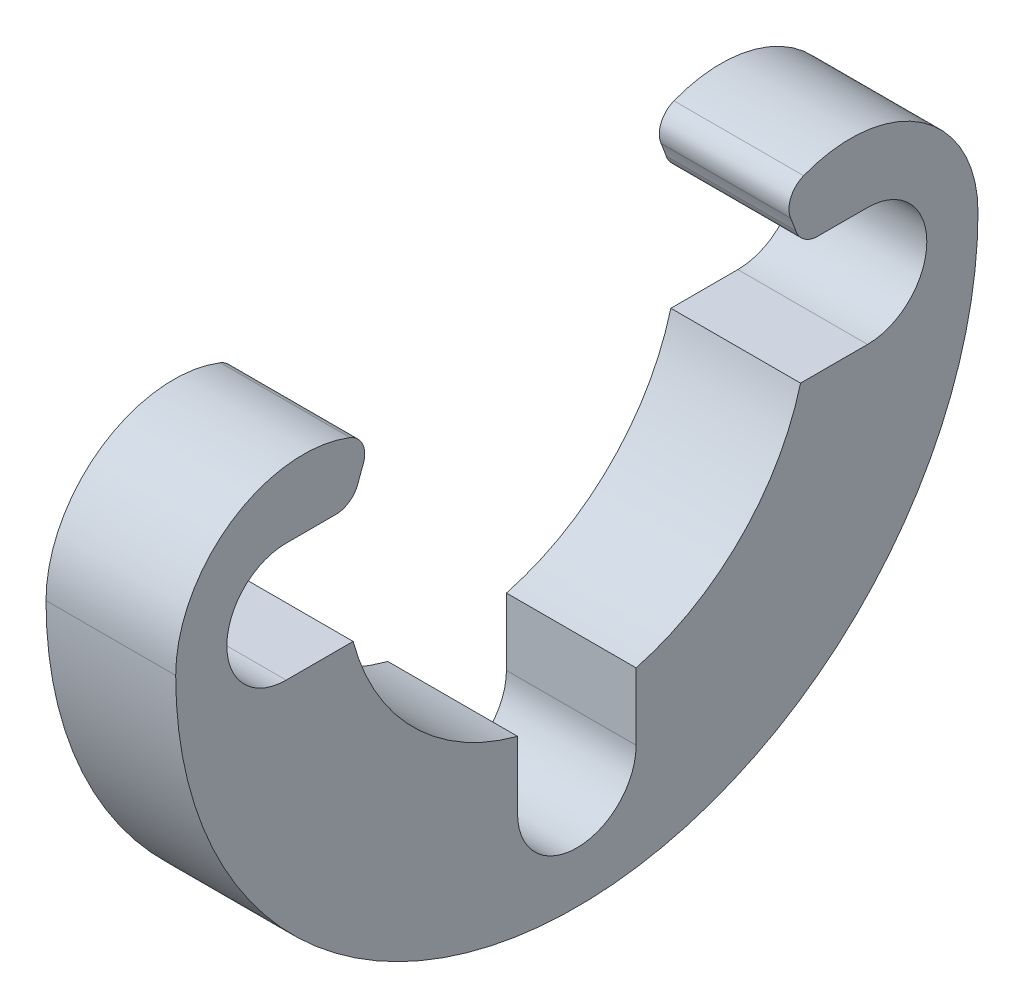
ISO-10303-21;
HEADER;
FILE_DESCRIPTION(('STEP AP214'),'2;1');
FILE_NAME('part.step','',(''),(''),'','','');
FILE_SCHEMA(('AUTOMOTIVE_DESIGN { 1 0 10303 214 1 1 1 1 }'));
ENDSEC;
DATA;
#1=APPLICATION_CONTEXT('core data for automotive mechanical design processes');
#2=APPLICATION_PROTOCOL_DEFINITION('international standard','automotive_design',2000,#1);
#3=PRODUCT_CONTEXT('',#1,'mechanical');
#4=PRODUCT('Part','Part','',(#3));
#5=PRODUCT_RELATED_PRODUCT_CATEGORY('part','',(#4));
#6=PRODUCT_DEFINITION_FORMATION('','',#4);
#7=PRODUCT_DEFINITION_CONTEXT('part definition',#1,'design');
#8=PRODUCT_DEFINITION('design','',#6,#7);
#9=PRODUCT_DEFINITION_SHAPE('','',#8);
#10=(LENGTH_UNIT() NAMED_UNIT(*) SI_UNIT(.MILLI.,.METRE.));
#11=(NAMED_UNIT(*) PLANE_ANGLE_UNIT() SI_UNIT($,.RADIAN.));
#12=(NAMED_UNIT(*) SI_UNIT($,.STERADIAN.) SOLID_ANGLE_UNIT());
#13=UNCERTAINTY_MEASURE_WITH_UNIT(LENGTH_MEASURE(1.E-05),#10,'distance_accuracy_value','');
#14=(GEOMETRIC_REPRESENTATION_CONTEXT(3) GLOBAL_UNCERTAINTY_ASSIGNED_CONTEXT((#13)) GLOBAL_UNIT_ASSIGNED_CONTEXT((#10,
#11,#12)) REPRESENTATION_CONTEXT('',''));
#15=CARTESIAN_POINT('',(0.,0.,0.));
#16=DIRECTION('',(0.,0.,1.));
#17=DIRECTION('',(1.,0.,0.));
#18=AXIS2_PLACEMENT_3D('',#15,#16,#17);
#19=CARTESIAN_POINT('',(-9.73629113398741,0.,7.97105));
#20=DIRECTION('',(1.,0.,0.));
#21=DIRECTION('',(0.,1.,0.));
#22=AXIS2_PLACEMENT_3D('',#19,#20,#21);
#23=CYLINDRICAL_SURFACE('',#22,1.6256);
#24=DIRECTION('',(-1.,0.,0.));
#25=VECTOR('',#24,1.);
#26=CARTESIAN_POINT('',(-1.5824,1.62560000000008,7.97105));
#27=LINE('',#26,#25);
#28=CARTESIAN_POINT('',(-1.5824,1.62560000000008,7.97105));
#29=VERTEX_POINT('',#28);
#30=CARTESIAN_POINT('',(-5.1384,1.62560000000008,7.97105));
#31=VERTEX_POINT('',#30);
#32=EDGE_CURVE('E239',#29,#31,#27,.T.);
#33=ORIENTED_EDGE('',*,*,#32,.F.);
#34=CARTESIAN_POINT('',(-1.5824,0.,7.97105));
#35=DIRECTION('',(1.,0.,0.));
#36=DIRECTION('',(0.,0.,1.));
#37=AXIS2_PLACEMENT_3D('',#34,#35,#36);
#38=CIRCLE('',#37,1.6256);
#39=CARTESIAN_POINT('',(-1.5824,-1.62559999999992,7.97105));
#40=VERTEX_POINT('',#39);
#41=EDGE_CURVE('E264',#29,#40,#38,.T.);
#42=ORIENTED_EDGE('',*,*,#41,.T.);
#43=DIRECTION('',(-1.,0.,0.));
#44=VECTOR('',#43,1.);
#45=CARTESIAN_POINT('',(-1.5824,-1.62559999999992,7.97105));
#46=LINE('',#45,#44);
#47=CARTESIAN_POINT('',(-5.1384,-1.62559999999992,7.97105));
#48=VERTEX_POINT('',#47);
#49=EDGE_CURVE('E241',#40,#48,#46,.T.);
#50=ORIENTED_EDGE('',*,*,#49,.T.);
#51=CARTESIAN_POINT('',(-5.1384,0.,7.97105));
#52=DIRECTION('',(-1.,0.,0.));
#53=DIRECTION('',(0.,-1.,0.));
#54=AXIS2_PLACEMENT_3D('',#51,#52,#53);
#55=CIRCLE('',#54,1.6256);
#56=EDGE_CURVE('E278',#31,#48,#55,.F.);
#57=ORIENTED_EDGE('',*,*,#56,.F.);
#58=EDGE_LOOP('',(#33,#42,#50,#57));
#59=FACE_BOUND('',#58,.T.);
#60=ADVANCED_FACE('F32',(#59),#23,.F.);
#61=CARTESIAN_POINT('',(-9.73629113398741,-7.97105,0.));
#62=DIRECTION('',(1.,0.,0.));
#63=DIRECTION('',(0.,1.,0.));
#64=AXIS2_PLACEMENT_3D('',#61,#62,#63);
#65=CYLINDRICAL_SURFACE('',#64,1.6256);
#66=DIRECTION('',(-1.,0.,0.));
#67=VECTOR('',#66,1.);
#68=CARTESIAN_POINT('',(-1.5824,-7.97105,1.6256));
#69=LINE('',#68,#67);
#70=CARTESIAN_POINT('',(-1.5824,-7.97105,1.6256));
#71=VERTEX_POINT('',#70);
#72=CARTESIAN_POINT('',(-5.1384,-7.97105,1.6256));
#73=VERTEX_POINT('',#72);
#74=EDGE_CURVE('E248',#71,#73,#69,.T.);
#75=ORIENTED_EDGE('',*,*,#74,.F.);
#76=CARTESIAN_POINT('',(-1.5824,-7.97105,0.));
#77=DIRECTION('',(1.,0.,0.));
#78=DIRECTION('',(0.,-1.,0.));
#79=AXIS2_PLACEMENT_3D('',#76,#77,#78);
#80=CIRCLE('',#79,1.6256);
#81=CARTESIAN_POINT('',(-1.5824,-7.97105,-1.6256));
#82=VERTEX_POINT('',#81);
#83=EDGE_CURVE('E275',#71,#82,#80,.T.);
#84=ORIENTED_EDGE('',*,*,#83,.T.);
#85=DIRECTION('',(-1.,0.,0.));
#86=VECTOR('',#85,1.);
#87=CARTESIAN_POINT('',(-1.5824,-7.97105,-1.6256));
#88=LINE('',#87,#86);
#89=CARTESIAN_POINT('',(-5.1384,-7.97105,-1.6256));
#90=VERTEX_POINT('',#89);
#91=EDGE_CURVE('E250',#82,#90,#88,.T.);
#92=ORIENTED_EDGE('',*,*,#91,.T.);
#93=CARTESIAN_POINT('',(-5.1384,-7.97105,0.));
#94=DIRECTION('',(-1.,0.,0.));
#95=DIRECTION('',(0.,-1.,0.));
#96=AXIS2_PLACEMENT_3D('',#93,#94,#95);
#97=CIRCLE('',#96,1.6256);
#98=EDGE_CURVE('E271',#73,#90,#97,.F.);
#99=ORIENTED_EDGE('',*,*,#98,.F.);
#100=EDGE_LOOP('',(#75,#84,#92,#99));
#101=FACE_BOUND('',#100,.T.);
#102=ADVANCED_FACE('F373',(#101),#65,.F.);
#103=CARTESIAN_POINT('',(0.,0.,0.));
#104=DIRECTION('',(1.,0.,0.));
#105=DIRECTION('',(0.,1.,0.));
#106=AXIS2_PLACEMENT_3D('',#103,#104,#105);
#107=CYLINDRICAL_SURFACE('',#106,11.);
#108=CARTESIAN_POINT('',(-1.5824,0.,0.));
#109=DIRECTION('',(1.,0.,0.));
#110=DIRECTION('',(0.,1.,0.));
#111=AXIS2_PLACEMENT_3D('',#108,#109,#110);
#112=CIRCLE('',#111,11.);
#113=CARTESIAN_POINT('',(-1.5824,0.,11.));
#114=VERTEX_POINT('',#113);
#115=CARTESIAN_POINT('',(-1.5824,0.,-11.));
#116=VERTEX_POINT('',#115);
#117=EDGE_CURVE('E274',#114,#116,#112,.T.);
#118=ORIENTED_EDGE('',*,*,#117,.F.);
#119=DIRECTION('',(-1.,0.,0.));
#120=VECTOR('',#119,1.);
#121=CARTESIAN_POINT('',(23.0143477524977,0.,11.));
#122=LINE('',#121,#120);
#123=CARTESIAN_POINT('',(-5.1384,0.,11.));
#124=VERTEX_POINT('',#123);
#125=EDGE_CURVE('E261',#114,#124,#122,.T.);
#126=ORIENTED_EDGE('',*,*,#125,.T.);
#127=CARTESIAN_POINT('',(-5.1384,0.,0.));
#128=DIRECTION('',(1.,0.,0.));
#129=DIRECTION('',(0.,1.,0.));
#130=AXIS2_PLACEMENT_3D('',#127,#128,#129);
#131=CIRCLE('',#130,11.);
#132=CARTESIAN_POINT('',(-5.1384,0.,-11.));
#133=VERTEX_POINT('',#132);
#134=EDGE_CURVE('E287',#124,#133,#131,.T.);
#135=ORIENTED_EDGE('',*,*,#134,.T.);
#136=DIRECTION('',(-1.,0.,0.));
#137=VECTOR('',#136,1.);
#138=CARTESIAN_POINT('',(23.0143477524977,0.,-11.));
#139=LINE('',#138,#137);
#140=EDGE_CURVE('E265',#116,#133,#139,.T.);
#141=ORIENTED_EDGE('',*,*,#140,.F.);
#142=EDGE_LOOP('',(#118,#126,#135,#141));
#143=FACE_BOUND('',#142,.T.);
#144=ADVANCED_FACE('F341',(#143),#107,.T.);
#145=CARTESIAN_POINT('',(-1.5824,11.,0.));
#146=DIRECTION('',(1.,0.,0.));
#147=DIRECTION('',(0.,1.,0.));
#148=AXIS2_PLACEMENT_3D('',#145,#146,#147);
#149=PLANE('',#148);
#150=CARTESIAN_POINT('',(-1.5824,0.,-7.5));
#151=DIRECTION('',(1.,0.,0.));
#152=DIRECTION('',(0.,1.,0.));
#153=AXIS2_PLACEMENT_3D('',#150,#151,#152);
#154=CIRCLE('',#153,3.5);
#155=CARTESIAN_POINT('',(-1.5824,3.25706571671838,-6.21878069130308));
#156=VERTEX_POINT('',#155);
#157=EDGE_CURVE('E262',#116,#156,#154,.T.);
#158=ORIENTED_EDGE('',*,*,#157,.T.);
#159=CARTESIAN_POINT('',(-1.5824,2.66614093668519,-6.45123048016667));
#160=DIRECTION('',(1.,0.,0.));
#161=DIRECTION('',(0.,1.,0.));
#162=AXIS2_PLACEMENT_3D('',#159,#160,#161);
#163=CIRCLE('',#162,0.635);
#164=CARTESIAN_POINT('',(-1.5824,2.42360650197179,-5.86437270525161));
#165=VERTEX_POINT('',#164);
#166=EDGE_CURVE('E299',#156,#165,#163,.T.);
#167=ORIENTED_EDGE('',*,*,#166,.T.);
#168=CARTESIAN_POINT('',(-1.5824,0.,0.));
#169=DIRECTION('',(-1.,0.,0.));
#170=DIRECTION('',(0.,-1.,0.));
#171=AXIS2_PLACEMENT_3D('',#168,#169,#170);
#172=CIRCLE('',#171,6.34545);
#173=CARTESIAN_POINT('',(-1.5824,2.05495695406454,-6.00348962016608));
#174=VERTEX_POINT('',#173);
#175=EDGE_CURVE('E212',#165,#174,#172,.T.);
#176=ORIENTED_EDGE('',*,*,#175,.T.);
#177=CARTESIAN_POINT('',(-1.5824,2.26059999999997,-6.60426906194017));
#178=DIRECTION('',(1.,0.,0.));
#179=DIRECTION('',(0.,1.,0.));
#180=AXIS2_PLACEMENT_3D('',#177,#178,#179);
#181=CIRCLE('',#180,0.635);
#182=CARTESIAN_POINT('',(-1.5824,1.62559999999997,-6.60426906194017));
#183=VERTEX_POINT('',#182);
#184=EDGE_CURVE('E297',#174,#183,#181,.T.);
#185=ORIENTED_EDGE('',*,*,#184,.T.);
#186=DIRECTION('',(0.,0.,-1.));
#187=VECTOR('',#186,1.);
#188=CARTESIAN_POINT('',(-1.5824,1.62559999999997,-7.97105));
#189=LINE('',#188,#187);
#190=CARTESIAN_POINT('',(-1.5824,1.62559999999997,-7.97105));
#191=VERTEX_POINT('',#190);
#192=EDGE_CURVE('E216',#183,#191,#189,.T.);
#193=ORIENTED_EDGE('',*,*,#192,.T.);
#194=CARTESIAN_POINT('',(-1.5824,0.,-7.97105));
#195=DIRECTION('',(1.,0.,0.));
#196=DIRECTION('',(0.,0.,-1.));
#197=AXIS2_PLACEMENT_3D('',#194,#195,#196);
#198=CIRCLE('',#197,1.6256);
#199=CARTESIAN_POINT('',(-1.5824,-1.62560000000003,-7.97105));
#200=VERTEX_POINT('',#199);
#201=EDGE_CURVE('E193',#200,#191,#198,.T.);
#202=ORIENTED_EDGE('',*,*,#201,.F.);
#203=DIRECTION('',(0.,0.,1.));
#204=VECTOR('',#203,1.);
#205=CARTESIAN_POINT('',(-1.5824,-1.62560000000003,-7.97105));
#206=LINE('',#205,#204);
#207=CARTESIAN_POINT('',(-1.5824,-1.62560000000002,-6.13369059722611));
#208=VERTEX_POINT('',#207);
#209=EDGE_CURVE('E171',#200,#208,#206,.T.);
#210=ORIENTED_EDGE('',*,*,#209,.T.);
#211=CARTESIAN_POINT('',(-1.5824,0.,0.));
#212=DIRECTION('',(-1.,0.,0.));
#213=DIRECTION('',(0.,-1.,0.));
#214=AXIS2_PLACEMENT_3D('',#211,#212,#213);
#215=CIRCLE('',#214,6.34545);
#216=CARTESIAN_POINT('',(-1.5824,-6.13369059722611,-1.6256));
#217=VERTEX_POINT('',#216);
#218=EDGE_CURVE('E182',#208,#217,#215,.T.);
#219=ORIENTED_EDGE('',*,*,#218,.T.);
#220=DIRECTION('',(0.,-1.,0.));
#221=VECTOR('',#220,1.);
#222=CARTESIAN_POINT('',(-1.5824,-7.97105,-1.6256));
#223=LINE('',#222,#221);
#224=EDGE_CURVE('E187',#217,#82,#223,.T.);
#225=ORIENTED_EDGE('',*,*,#224,.T.);
#226=ORIENTED_EDGE('',*,*,#83,.F.);
#227=DIRECTION('',(0.,1.,0.));
#228=VECTOR('',#227,1.);
#229=CARTESIAN_POINT('',(-1.5824,-7.97105,1.6256));
#230=LINE('',#229,#228);
#231=CARTESIAN_POINT('',(-1.5824,-6.13369059722611,1.6256));
#232=VERTEX_POINT('',#231);
#233=EDGE_CURVE('E200',#71,#232,#230,.T.);
#234=ORIENTED_EDGE('',*,*,#233,.T.);
#235=CARTESIAN_POINT('',(-1.5824,0.,0.));
#236=DIRECTION('',(-1.,0.,0.));
#237=DIRECTION('',(0.,-1.,0.));
#238=AXIS2_PLACEMENT_3D('',#235,#236,#237);
#239=CIRCLE('',#238,6.34545);
#240=CARTESIAN_POINT('',(-1.5824,-1.62560000000003,6.1336905972261));
#241=VERTEX_POINT('',#240);
#242=EDGE_CURVE('E203',#232,#241,#239,.T.);
#243=ORIENTED_EDGE('',*,*,#242,.T.);
#244=DIRECTION('',(0.,0.,1.));
#245=VECTOR('',#244,1.);
#246=CARTESIAN_POINT('',(-1.5824,-1.62559999999992,7.97105));
#247=LINE('',#246,#245);
#248=EDGE_CURVE('E206',#241,#40,#247,.T.);
#249=ORIENTED_EDGE('',*,*,#248,.T.);
#250=ORIENTED_EDGE('',*,*,#41,.F.);
#251=DIRECTION('',(0.,0.,-1.));
#252=VECTOR('',#251,1.);
#253=CARTESIAN_POINT('',(-1.5824,1.62560000000008,7.97105));
#254=LINE('',#253,#252);
#255=CARTESIAN_POINT('',(-1.5824,1.6256,6.6042690619402));
#256=VERTEX_POINT('',#255);
#257=EDGE_CURVE('E209',#29,#256,#254,.T.);
#258=ORIENTED_EDGE('',*,*,#257,.T.);
#259=CARTESIAN_POINT('',(-1.5824,2.2606,6.60426906194016));
#260=DIRECTION('',(1.,0.,0.));
#261=DIRECTION('',(0.,1.,0.));
#262=AXIS2_PLACEMENT_3D('',#259,#260,#261);
#263=CIRCLE('',#262,0.635);
#264=CARTESIAN_POINT('',(-1.5824,2.05495695406457,6.00348962016607));
#265=VERTEX_POINT('',#264);
#266=EDGE_CURVE('E293',#256,#265,#263,.T.);
#267=ORIENTED_EDGE('',*,*,#266,.T.);
#268=CARTESIAN_POINT('',(-1.5824,2.42360650197179,5.86437270525161));
#269=VERTEX_POINT('',#268);
#270=EDGE_CURVE('E215',#265,#269,#172,.T.);
#271=ORIENTED_EDGE('',*,*,#270,.T.);
#272=CARTESIAN_POINT('',(-1.5824,2.66614093668519,6.45123048016667));
#273=DIRECTION('',(1.,0.,0.));
#274=DIRECTION('',(0.,1.,0.));
#275=AXIS2_PLACEMENT_3D('',#272,#273,#274);
#276=CIRCLE('',#275,0.635);
#277=CARTESIAN_POINT('',(-1.5824,3.25706571671838,6.21878069130308));
#278=VERTEX_POINT('',#277);
#279=EDGE_CURVE('E295',#269,#278,#276,.T.);
#280=ORIENTED_EDGE('',*,*,#279,.T.);
#281=CARTESIAN_POINT('',(-1.5824,0.,7.5));
#282=DIRECTION('',(1.,0.,0.));
#283=DIRECTION('',(0.,1.,0.));
#284=AXIS2_PLACEMENT_3D('',#281,#282,#283);
#285=CIRCLE('',#284,3.5);
#286=EDGE_CURVE('E258',#278,#114,#285,.T.);
#287=ORIENTED_EDGE('',*,*,#286,.T.);
#288=ORIENTED_EDGE('',*,*,#117,.T.);
#289=EDGE_LOOP('',(#158,#167,#176,#185,#193,#202,#210,#219,#225,#226,#234,#243,#249,#250,#258,
#267,#271,#280,#287,#288));
#290=FACE_BOUND('',#289,.T.);
#291=ADVANCED_FACE('F191',(#290),#149,.T.);
#292=CARTESIAN_POINT('',(-5.1384,4.99999,0.));
#293=DIRECTION('',(-1.,0.,0.));
#294=DIRECTION('',(0.,-1.,0.));
#295=AXIS2_PLACEMENT_3D('',#292,#293,#294);
#296=PLANE('',#295);
#297=CARTESIAN_POINT('',(-5.1384,0.,0.));
#298=DIRECTION('',(-1.,0.,0.));
#299=DIRECTION('',(0.,-1.,0.));
#300=AXIS2_PLACEMENT_3D('',#297,#298,#299);
#301=CIRCLE('',#300,6.34545);
#302=CARTESIAN_POINT('',(-5.1384,2.42360650197179,-5.86437270525161));
#303=VERTEX_POINT('',#302);
#304=CARTESIAN_POINT('',(-5.1384,2.05495695406454,-6.00348962016608));
#305=VERTEX_POINT('',#304);
#306=EDGE_CURVE('E233',#303,#305,#301,.T.);
#307=ORIENTED_EDGE('',*,*,#306,.F.);
#308=CARTESIAN_POINT('',(-5.1384,2.66614093668519,-6.45123048016667));
#309=DIRECTION('',(-1.,0.,0.));
#310=DIRECTION('',(0.,-1.,0.));
#311=AXIS2_PLACEMENT_3D('',#308,#309,#310);
#312=CIRCLE('',#311,0.635);
#313=CARTESIAN_POINT('',(-5.1384,3.25706571671838,-6.21878069130308));
#314=VERTEX_POINT('',#313);
#315=EDGE_CURVE('E309',#303,#314,#312,.T.);
#316=ORIENTED_EDGE('',*,*,#315,.T.);
#317=CARTESIAN_POINT('',(-5.1384,0.,-7.5));
#318=DIRECTION('',(1.,0.,0.));
#319=DIRECTION('',(0.,-1.,0.));
#320=AXIS2_PLACEMENT_3D('',#317,#318,#319);
#321=CIRCLE('',#320,3.5);
#322=EDGE_CURVE('E255',#133,#314,#321,.T.);
#323=ORIENTED_EDGE('',*,*,#322,.F.);
#324=ORIENTED_EDGE('',*,*,#134,.F.);
#325=CARTESIAN_POINT('',(-5.1384,0.,7.5));
#326=DIRECTION('',(1.,0.,0.));
#327=DIRECTION('',(0.,1.,0.));
#328=AXIS2_PLACEMENT_3D('',#325,#326,#327);
#329=CIRCLE('',#328,3.5);
#330=CARTESIAN_POINT('',(-5.1384,3.25706571671838,6.21878069130308));
#331=VERTEX_POINT('',#330);
#332=EDGE_CURVE('E238',#331,#124,#329,.T.);
#333=ORIENTED_EDGE('',*,*,#332,.F.);
#334=CARTESIAN_POINT('',(-5.1384,2.66614093668519,6.45123048016667));
#335=DIRECTION('',(-1.,0.,0.));
#336=DIRECTION('',(0.,-1.,0.));
#337=AXIS2_PLACEMENT_3D('',#334,#335,#336);
#338=CIRCLE('',#337,0.635);
#339=CARTESIAN_POINT('',(-5.1384,2.42360650197179,5.86437270525161));
#340=VERTEX_POINT('',#339);
#341=EDGE_CURVE('E53',#331,#340,#338,.T.);
#342=ORIENTED_EDGE('',*,*,#341,.T.);
#343=CARTESIAN_POINT('',(-5.1384,2.05495695406457,6.00348962016607));
#344=VERTEX_POINT('',#343);
#345=EDGE_CURVE('E196',#344,#340,#301,.T.);
#346=ORIENTED_EDGE('',*,*,#345,.F.);
#347=CARTESIAN_POINT('',(-5.1384,2.2606,6.60426906194016));
#348=DIRECTION('',(-1.,0.,0.));
#349=DIRECTION('',(0.,-1.,0.));
#350=AXIS2_PLACEMENT_3D('',#347,#348,#349);
#351=CIRCLE('',#350,0.635);
#352=CARTESIAN_POINT('',(-5.1384,1.6256,6.6042690619402));
#353=VERTEX_POINT('',#352);
#354=EDGE_CURVE('E47',#344,#353,#351,.T.);
#355=ORIENTED_EDGE('',*,*,#354,.T.);
#356=DIRECTION('',(0.,0.,-1.));
#357=VECTOR('',#356,1.);
#358=CARTESIAN_POINT('',(-5.1384,1.62560000000008,7.97105));
#359=LINE('',#358,#357);
#360=EDGE_CURVE('E231',#31,#353,#359,.T.);
#361=ORIENTED_EDGE('',*,*,#360,.F.);
#362=ORIENTED_EDGE('',*,*,#56,.T.);
#363=DIRECTION('',(0.,0.,1.));
#364=VECTOR('',#363,1.);
#365=CARTESIAN_POINT('',(-5.1384,-1.62559999999992,7.97105));
#366=LINE('',#365,#364);
#367=CARTESIAN_POINT('',(-5.1384,-1.62560000000003,6.1336905972261));
#368=VERTEX_POINT('',#367);
#369=EDGE_CURVE('E229',#368,#48,#366,.T.);
#370=ORIENTED_EDGE('',*,*,#369,.F.);
#371=CARTESIAN_POINT('',(-5.1384,0.,0.));
#372=DIRECTION('',(-1.,0.,0.));
#373=DIRECTION('',(0.,-1.,0.));
#374=AXIS2_PLACEMENT_3D('',#371,#372,#373);
#375=CIRCLE('',#374,6.34545);
#376=CARTESIAN_POINT('',(-5.1384,-6.13369059722611,1.6256));
#377=VERTEX_POINT('',#376);
#378=EDGE_CURVE('E226',#377,#368,#375,.T.);
#379=ORIENTED_EDGE('',*,*,#378,.F.);
#380=DIRECTION('',(0.,1.,0.));
#381=VECTOR('',#380,1.);
#382=CARTESIAN_POINT('',(-5.1384,-7.97105,1.6256));
#383=LINE('',#382,#381);
#384=EDGE_CURVE('E223',#73,#377,#383,.T.);
#385=ORIENTED_EDGE('',*,*,#384,.F.);
#386=ORIENTED_EDGE('',*,*,#98,.T.);
#387=DIRECTION('',(0.,-1.,0.));
#388=VECTOR('',#387,1.);
#389=CARTESIAN_POINT('',(-5.1384,-7.97105,-1.6256));
#390=LINE('',#389,#388);
#391=CARTESIAN_POINT('',(-5.1384,-6.13369059722611,-1.6256));
#392=VERTEX_POINT('',#391);
#393=EDGE_CURVE('E221',#392,#90,#390,.T.);
#394=ORIENTED_EDGE('',*,*,#393,.F.);
#395=CARTESIAN_POINT('',(-5.1384,0.,0.));
#396=DIRECTION('',(-1.,0.,0.));
#397=DIRECTION('',(0.,-1.,0.));
#398=AXIS2_PLACEMENT_3D('',#395,#396,#397);
#399=CIRCLE('',#398,6.34545);
#400=CARTESIAN_POINT('',(-5.1384,-1.62560000000003,-6.13369059722611));
#401=VERTEX_POINT('',#400);
#402=EDGE_CURVE('E219',#401,#392,#399,.T.);
#403=ORIENTED_EDGE('',*,*,#402,.F.);
#404=DIRECTION('',(0.,0.,1.));
#405=VECTOR('',#404,1.);
#406=CARTESIAN_POINT('',(-5.1384,-1.62560000000003,-7.97105));
#407=LINE('',#406,#405);
#408=CARTESIAN_POINT('',(-5.1384,-1.62560000000003,-7.97105));
#409=VERTEX_POINT('',#408);
#410=EDGE_CURVE('E174',#409,#401,#407,.T.);
#411=ORIENTED_EDGE('',*,*,#410,.F.);
#412=CARTESIAN_POINT('',(-5.1384,0.,-7.97105));
#413=DIRECTION('',(-1.,0.,0.));
#414=DIRECTION('',(0.,-1.,0.));
#415=AXIS2_PLACEMENT_3D('',#412,#413,#414);
#416=CIRCLE('',#415,1.6256);
#417=CARTESIAN_POINT('',(-5.1384,1.62559999999997,-7.97105));
#418=VERTEX_POINT('',#417);
#419=EDGE_CURVE('E270',#409,#418,#416,.F.);
#420=ORIENTED_EDGE('',*,*,#419,.T.);
#421=DIRECTION('',(0.,0.,-1.));
#422=VECTOR('',#421,1.);
#423=CARTESIAN_POINT('',(-5.1384,1.62559999999997,-7.97105));
#424=LINE('',#423,#422);
#425=CARTESIAN_POINT('',(-5.1384,1.62559999999997,-6.60426906194017));
#426=VERTEX_POINT('',#425);
#427=EDGE_CURVE('E194',#426,#418,#424,.T.);
#428=ORIENTED_EDGE('',*,*,#427,.F.);
#429=CARTESIAN_POINT('',(-5.1384,2.26059999999997,-6.60426906194017));
#430=DIRECTION('',(-1.,0.,0.));
#431=DIRECTION('',(0.,-1.,0.));
#432=AXIS2_PLACEMENT_3D('',#429,#430,#431);
#433=CIRCLE('',#432,0.635);
#434=EDGE_CURVE('E307',#426,#305,#433,.T.);
#435=ORIENTED_EDGE('',*,*,#434,.T.);
#436=EDGE_LOOP('',(#307,#316,#323,#324,#333,#342,#346,#355,#361,#362,#370,#379,#385,#386,#394,
#403,#411,#420,#428,#435));
#437=FACE_BOUND('',#436,.T.);
#438=ADVANCED_FACE('F336',(#437),#296,.T.);
#439=CARTESIAN_POINT('',(-9.73629113398741,0.,-7.97105));
#440=DIRECTION('',(1.,0.,0.));
#441=DIRECTION('',(0.,1.,0.));
#442=AXIS2_PLACEMENT_3D('',#439,#440,#441);
#443=CYLINDRICAL_SURFACE('',#442,1.6256);
#444=ORIENTED_EDGE('',*,*,#201,.T.);
#445=DIRECTION('',(-1.,0.,0.));
#446=VECTOR('',#445,1.);
#447=CARTESIAN_POINT('',(-1.5824,1.62559999999997,-7.97105));
#448=LINE('',#447,#446);
#449=EDGE_CURVE('E235',#191,#418,#448,.T.);
#450=ORIENTED_EDGE('',*,*,#449,.T.);
#451=ORIENTED_EDGE('',*,*,#419,.F.);
#452=DIRECTION('',(-1.,0.,0.));
#453=VECTOR('',#452,1.);
#454=CARTESIAN_POINT('',(-1.5824,-1.62560000000003,-7.97105));
#455=LINE('',#454,#453);
#456=EDGE_CURVE('E179',#200,#409,#455,.T.);
#457=ORIENTED_EDGE('',*,*,#456,.F.);
#458=EDGE_LOOP('',(#444,#450,#451,#457));
#459=FACE_BOUND('',#458,.T.);
#460=ADVANCED_FACE('F365',(#459),#443,.F.);
#461=CARTESIAN_POINT('',(23.0143477524977,0.,7.5));
#462=DIRECTION('',(-1.,0.,0.));
#463=DIRECTION('',(0.,-1.,0.));
#464=AXIS2_PLACEMENT_3D('',#461,#462,#463);
#465=CYLINDRICAL_SURFACE('',#464,3.5);
#466=ORIENTED_EDGE('',*,*,#286,.F.);
#467=DIRECTION('',(-1.,0.,0.));
#468=VECTOR('',#467,1.);
#469=CARTESIAN_POINT('',(23.0143477524977,3.25706571671838,6.21878069130308));
#470=LINE('',#469,#468);
#471=EDGE_CURVE('E314',#278,#331,#470,.T.);
#472=ORIENTED_EDGE('',*,*,#471,.T.);
#473=ORIENTED_EDGE('',*,*,#332,.T.);
#474=ORIENTED_EDGE('',*,*,#125,.F.);
#475=EDGE_LOOP('',(#466,#472,#473,#474));
#476=FACE_BOUND('',#475,.T.);
#477=ADVANCED_FACE('F332',(#476),#465,.T.);
#478=CARTESIAN_POINT('',(23.0143477524977,0.,-7.5));
#479=DIRECTION('',(-1.,0.,0.));
#480=DIRECTION('',(0.,-1.,0.));
#481=AXIS2_PLACEMENT_3D('',#478,#479,#480);
#482=CYLINDRICAL_SURFACE('',#481,3.5);
#483=ORIENTED_EDGE('',*,*,#322,.T.);
#484=DIRECTION('',(-1.,0.,0.));
#485=VECTOR('',#484,1.);
#486=CARTESIAN_POINT('',(23.0143477524977,3.25706571671838,-6.21878069130308));
#487=LINE('',#486,#485);
#488=EDGE_CURVE('E290',#314,#156,#487,.F.);
#489=ORIENTED_EDGE('',*,*,#488,.T.);
#490=ORIENTED_EDGE('',*,*,#157,.F.);
#491=ORIENTED_EDGE('',*,*,#140,.T.);
#492=EDGE_LOOP('',(#483,#489,#490,#491));
#493=FACE_BOUND('',#492,.T.);
#494=ADVANCED_FACE('F344',(#493),#482,.T.);
#495=CARTESIAN_POINT('',(-1.5824,0.,0.));
#496=DIRECTION('',(-1.,0.,0.));
#497=DIRECTION('',(0.,-1.,0.));
#498=AXIS2_PLACEMENT_3D('',#495,#496,#497);
#499=CYLINDRICAL_SURFACE('',#498,6.34545);
#500=ORIENTED_EDGE('',*,*,#175,.F.);
#501=DIRECTION('',(-1.,0.,0.));
#502=VECTOR('',#501,1.);
#503=CARTESIAN_POINT('',(-1.5824,2.42360650197179,-5.86437270525161));
#504=LINE('',#503,#502);
#505=EDGE_CURVE('E303',#165,#303,#504,.T.);
#506=ORIENTED_EDGE('',*,*,#505,.T.);
#507=ORIENTED_EDGE('',*,*,#306,.T.);
#508=DIRECTION('',(-1.,0.,0.));
#509=VECTOR('',#508,1.);
#510=CARTESIAN_POINT('',(-1.5824,2.05495695406454,-6.00348962016608));
#511=LINE('',#510,#509);
#512=EDGE_CURVE('E301',#305,#174,#511,.F.);
#513=ORIENTED_EDGE('',*,*,#512,.T.);
#514=EDGE_LOOP('',(#500,#506,#507,#513));
#515=FACE_BOUND('',#514,.T.);
#516=ADVANCED_FACE('F352',(#515),#499,.F.);
#517=CARTESIAN_POINT('',(-1.5824,1.62559999999997,-7.97105));
#518=DIRECTION('',(0.,1.,0.));
#519=DIRECTION('',(-1.,0.,0.));
#520=AXIS2_PLACEMENT_3D('',#517,#518,#519);
#521=PLANE('',#520);
#522=ORIENTED_EDGE('',*,*,#192,.F.);
#523=DIRECTION('',(-1.,0.,0.));
#524=VECTOR('',#523,1.);
#525=CARTESIAN_POINT('',(-1.5824,1.62559999999997,-6.60426906194017));
#526=LINE('',#525,#524);
#527=EDGE_CURVE('E311',#183,#426,#526,.T.);
#528=ORIENTED_EDGE('',*,*,#527,.T.);
#529=ORIENTED_EDGE('',*,*,#427,.T.);
#530=ORIENTED_EDGE('',*,*,#449,.F.);
#531=EDGE_LOOP('',(#522,#528,#529,#530));
#532=FACE_BOUND('',#531,.T.);
#533=ADVANCED_FACE('F361',(#532),#521,.F.);
#534=ORIENTED_EDGE('',*,*,#345,.T.);
#535=DIRECTION('',(-1.,0.,0.));
#536=VECTOR('',#535,1.);
#537=CARTESIAN_POINT('',(-1.5824,2.42360650197179,5.86437270525161));
#538=LINE('',#537,#536);
#539=EDGE_CURVE('E40',#340,#269,#538,.F.);
#540=ORIENTED_EDGE('',*,*,#539,.T.);
#541=ORIENTED_EDGE('',*,*,#270,.F.);
#542=DIRECTION('',(-1.,0.,0.));
#543=VECTOR('',#542,1.);
#544=CARTESIAN_POINT('',(-1.5824,2.05495695406457,6.00348962016607));
#545=LINE('',#544,#543);
#546=EDGE_CURVE('E317',#265,#344,#545,.T.);
#547=ORIENTED_EDGE('',*,*,#546,.T.);
#548=EDGE_LOOP('',(#534,#540,#541,#547));
#549=FACE_BOUND('',#548,.T.);
#550=ADVANCED_FACE('F323',(#549),#499,.F.);
#551=CARTESIAN_POINT('',(-1.5824,1.62560000000008,7.97105));
#552=DIRECTION('',(0.,1.,0.));
#553=DIRECTION('',(0.,0.,1.));
#554=AXIS2_PLACEMENT_3D('',#551,#552,#553);
#555=PLANE('',#554);
#556=ORIENTED_EDGE('',*,*,#360,.T.);
#557=DIRECTION('',(-1.,0.,0.));
#558=VECTOR('',#557,1.);
#559=CARTESIAN_POINT('',(-1.5824,1.6256,6.6042690619402));
#560=LINE('',#559,#558);
#561=EDGE_CURVE('E11',#353,#256,#560,.F.);
#562=ORIENTED_EDGE('',*,*,#561,.T.);
#563=ORIENTED_EDGE('',*,*,#257,.F.);
#564=ORIENTED_EDGE('',*,*,#32,.T.);
#565=EDGE_LOOP('',(#556,#562,#563,#564));
#566=FACE_BOUND('',#565,.T.);
#567=ADVANCED_FACE('F390',(#566),#555,.F.);
#568=CARTESIAN_POINT('',(-1.5824,-7.97105,-1.6256));
#569=DIRECTION('',(0.,0.,-1.));
#570=DIRECTION('',(-1.,0.,0.));
#571=AXIS2_PLACEMENT_3D('',#568,#569,#570);
#572=PLANE('',#571);
#573=ORIENTED_EDGE('',*,*,#393,.T.);
#574=ORIENTED_EDGE('',*,*,#91,.F.);
#575=ORIENTED_EDGE('',*,*,#224,.F.);
#576=DIRECTION('',(-1.,0.,0.));
#577=VECTOR('',#576,1.);
#578=CARTESIAN_POINT('',(-1.5824,-6.13369059722611,-1.6256));
#579=LINE('',#578,#577);
#580=EDGE_CURVE('E178',#217,#392,#579,.T.);
#581=ORIENTED_EDGE('',*,*,#580,.T.);
#582=EDGE_LOOP('',(#573,#574,#575,#581));
#583=FACE_BOUND('',#582,.T.);
#584=ADVANCED_FACE('F370',(#583),#572,.F.);
#585=CARTESIAN_POINT('',(-1.5824,-1.62560000000003,-7.97105));
#586=DIRECTION('',(0.,-1.,0.));
#587=DIRECTION('',(1.,0.,0.));
#588=AXIS2_PLACEMENT_3D('',#585,#586,#587);
#589=PLANE('',#588);
#590=ORIENTED_EDGE('',*,*,#410,.T.);
#591=DIRECTION('',(-1.,0.,0.));
#592=VECTOR('',#591,1.);
#593=CARTESIAN_POINT('',(-1.5824,-1.62560000000002,-6.13369059722611));
#594=LINE('',#593,#592);
#595=EDGE_CURVE('E167',#208,#401,#594,.T.);
#596=ORIENTED_EDGE('',*,*,#595,.F.);
#597=ORIENTED_EDGE('',*,*,#209,.F.);
#598=ORIENTED_EDGE('',*,*,#456,.T.);
#599=EDGE_LOOP('',(#590,#596,#597,#598));
#600=FACE_BOUND('',#599,.T.);
#601=ADVANCED_FACE('F169',(#600),#589,.F.);
#602=CARTESIAN_POINT('',(-1.5824,0.,0.));
#603=DIRECTION('',(-1.,0.,0.));
#604=DIRECTION('',(0.,-1.,0.));
#605=AXIS2_PLACEMENT_3D('',#602,#603,#604);
#606=CYLINDRICAL_SURFACE('',#605,6.34545);
#607=ORIENTED_EDGE('',*,*,#402,.T.);
#608=ORIENTED_EDGE('',*,*,#580,.F.);
#609=ORIENTED_EDGE('',*,*,#218,.F.);
#610=ORIENTED_EDGE('',*,*,#595,.T.);
#611=EDGE_LOOP('',(#607,#608,#609,#610));
#612=FACE_BOUND('',#611,.T.);
#613=ADVANCED_FACE('F183',(#612),#606,.F.);
#614=CARTESIAN_POINT('',(-1.5824,-1.62559999999992,7.97105));
#615=DIRECTION('',(0.,-1.,0.));
#616=DIRECTION('',(0.,0.,-1.));
#617=AXIS2_PLACEMENT_3D('',#614,#615,#616);
#618=PLANE('',#617);
#619=ORIENTED_EDGE('',*,*,#369,.T.);
#620=ORIENTED_EDGE('',*,*,#49,.F.);
#621=ORIENTED_EDGE('',*,*,#248,.F.);
#622=DIRECTION('',(-1.,0.,0.));
#623=VECTOR('',#622,1.);
#624=CARTESIAN_POINT('',(-1.5824,-1.62560000000003,6.1336905972261));
#625=LINE('',#624,#623);
#626=EDGE_CURVE('E244',#241,#368,#625,.T.);
#627=ORIENTED_EDGE('',*,*,#626,.T.);
#628=EDGE_LOOP('',(#619,#620,#621,#627));
#629=FACE_BOUND('',#628,.T.);
#630=ADVANCED_FACE('F384',(#629),#618,.F.);
#631=CARTESIAN_POINT('',(-1.5824,0.,0.));
#632=DIRECTION('',(-1.,0.,0.));
#633=DIRECTION('',(0.,-1.,0.));
#634=AXIS2_PLACEMENT_3D('',#631,#632,#633);
#635=CYLINDRICAL_SURFACE('',#634,6.34545);
#636=ORIENTED_EDGE('',*,*,#378,.T.);
#637=ORIENTED_EDGE('',*,*,#626,.F.);
#638=ORIENTED_EDGE('',*,*,#242,.F.);
#639=DIRECTION('',(-1.,0.,0.));
#640=VECTOR('',#639,1.);
#641=CARTESIAN_POINT('',(-1.5824,-6.13369059722611,1.6256));
#642=LINE('',#641,#640);
#643=EDGE_CURVE('E246',#232,#377,#642,.T.);
#644=ORIENTED_EDGE('',*,*,#643,.T.);
#645=EDGE_LOOP('',(#636,#637,#638,#644));
#646=FACE_BOUND('',#645,.T.);
#647=ADVANCED_FACE('F380',(#646),#635,.F.);
#648=CARTESIAN_POINT('',(-1.5824,-7.97105,1.6256));
#649=DIRECTION('',(0.,0.,1.));
#650=DIRECTION('',(1.,0.,0.));
#651=AXIS2_PLACEMENT_3D('',#648,#649,#650);
#652=PLANE('',#651);
#653=ORIENTED_EDGE('',*,*,#384,.T.);
#654=ORIENTED_EDGE('',*,*,#643,.F.);
#655=ORIENTED_EDGE('',*,*,#233,.F.);
#656=ORIENTED_EDGE('',*,*,#74,.T.);
#657=EDGE_LOOP('',(#653,#654,#655,#656));
#658=FACE_BOUND('',#657,.T.);
#659=ADVANCED_FACE('F377',(#658),#652,.F.);
#660=CARTESIAN_POINT('',(-1.5824,2.66614093668519,-6.45123048016667));
#661=DIRECTION('',(-1.,0.,0.));
#662=DIRECTION('',(0.,-1.,0.));
#663=AXIS2_PLACEMENT_3D('',#660,#661,#662);
#664=CYLINDRICAL_SURFACE('',#663,0.635);
#665=ORIENTED_EDGE('',*,*,#315,.F.);
#666=ORIENTED_EDGE('',*,*,#505,.F.);
#667=ORIENTED_EDGE('',*,*,#166,.F.);
#668=ORIENTED_EDGE('',*,*,#488,.F.);
#669=EDGE_LOOP('',(#665,#666,#667,#668));
#670=FACE_BOUND('',#669,.T.);
#671=ADVANCED_FACE('F348',(#670),#664,.T.);
#672=CARTESIAN_POINT('',(-1.5824,2.26059999999997,-6.60426906194017));
#673=DIRECTION('',(-1.,0.,0.));
#674=DIRECTION('',(0.,-1.,0.));
#675=AXIS2_PLACEMENT_3D('',#672,#673,#674);
#676=CYLINDRICAL_SURFACE('',#675,0.635);
#677=ORIENTED_EDGE('',*,*,#184,.F.);
#678=ORIENTED_EDGE('',*,*,#512,.F.);
#679=ORIENTED_EDGE('',*,*,#434,.F.);
#680=ORIENTED_EDGE('',*,*,#527,.F.);
#681=EDGE_LOOP('',(#677,#678,#679,#680));
#682=FACE_BOUND('',#681,.T.);
#683=ADVANCED_FACE('F358',(#682),#676,.T.);
#684=CARTESIAN_POINT('',(-1.5824,2.66614093668519,6.45123048016667));
#685=DIRECTION('',(1.,0.,0.));
#686=DIRECTION('',(0.,1.,0.));
#687=AXIS2_PLACEMENT_3D('',#684,#685,#686);
#688=CYLINDRICAL_SURFACE('',#687,0.635);
#689=ORIENTED_EDGE('',*,*,#279,.F.);
#690=ORIENTED_EDGE('',*,*,#539,.F.);
#691=ORIENTED_EDGE('',*,*,#341,.F.);
#692=ORIENTED_EDGE('',*,*,#471,.F.);
#693=EDGE_LOOP('',(#689,#690,#691,#692));
#694=FACE_BOUND('',#693,.T.);
#695=ADVANCED_FACE('F330',(#694),#688,.T.);
#696=CARTESIAN_POINT('',(-1.5824,2.2606,6.60426906194016));
#697=DIRECTION('',(-1.,0.,0.));
#698=DIRECTION('',(0.,-1.,0.));
#699=AXIS2_PLACEMENT_3D('',#696,#697,#698);
#700=CYLINDRICAL_SURFACE('',#699,0.635);
#701=ORIENTED_EDGE('',*,*,#266,.F.);
#702=ORIENTED_EDGE('',*,*,#561,.F.);
#703=ORIENTED_EDGE('',*,*,#354,.F.);
#704=ORIENTED_EDGE('',*,*,#546,.F.);
#705=EDGE_LOOP('',(#701,#702,#703,#704));
#706=FACE_BOUND('',#705,.T.);
#707=ADVANCED_FACE('F34',(#706),#700,.T.);
#708=CLOSED_SHELL('',(#60,#102,#144,#291,#438,#460,#477,#494,#516,#533,#550,#567,#584,#601,#613,
#630,#647,#659,#671,#683,#695,#707));
#709=MANIFOLD_SOLID_BREP('B2',#708);
#710=ADVANCED_BREP_SHAPE_REPRESENTATION('',(#18,#709),#14);
#711=SHAPE_DEFINITION_REPRESENTATION(#9,#710);
ENDSEC;
END-ISO-10303-21;
